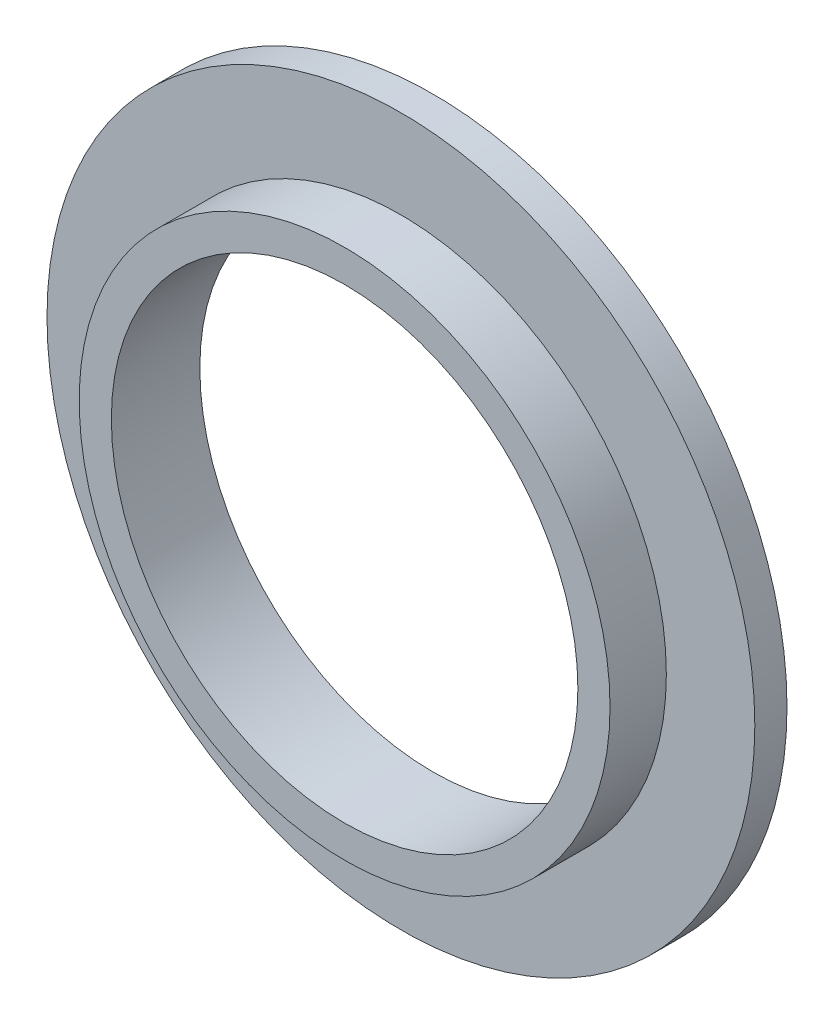
ISO-10303-21;
HEADER;
FILE_DESCRIPTION(('STEP AP214'),'2;1');
FILE_NAME('part.step','',(''),(''),'','','');
FILE_SCHEMA(('AUTOMOTIVE_DESIGN { 1 0 10303 214 1 1 1 1 }'));
ENDSEC;
DATA;
#1=APPLICATION_CONTEXT('core data for automotive mechanical design processes');
#2=APPLICATION_PROTOCOL_DEFINITION('international standard','automotive_design',2000,#1);
#3=PRODUCT_CONTEXT('',#1,'mechanical');
#4=PRODUCT('Part','Part','',(#3));
#5=PRODUCT_RELATED_PRODUCT_CATEGORY('part','',(#4));
#6=PRODUCT_DEFINITION_FORMATION('','',#4);
#7=PRODUCT_DEFINITION_CONTEXT('part definition',#1,'design');
#8=PRODUCT_DEFINITION('design','',#6,#7);
#9=PRODUCT_DEFINITION_SHAPE('','',#8);
#10=(LENGTH_UNIT() NAMED_UNIT(*) SI_UNIT(.MILLI.,.METRE.));
#11=(NAMED_UNIT(*) PLANE_ANGLE_UNIT() SI_UNIT($,.RADIAN.));
#12=(NAMED_UNIT(*) SI_UNIT($,.STERADIAN.) SOLID_ANGLE_UNIT());
#13=UNCERTAINTY_MEASURE_WITH_UNIT(LENGTH_MEASURE(1.E-05),#10,'distance_accuracy_value','');
#14=(GEOMETRIC_REPRESENTATION_CONTEXT(3) GLOBAL_UNCERTAINTY_ASSIGNED_CONTEXT((#13)) GLOBAL_UNIT_ASSIGNED_CONTEXT((#10,
#11,#12)) REPRESENTATION_CONTEXT('',''));
#15=CARTESIAN_POINT('',(0.,0.,0.));
#16=DIRECTION('',(0.,0.,1.));
#17=DIRECTION('',(1.,0.,0.));
#18=AXIS2_PLACEMENT_3D('',#15,#16,#17);
#19=CARTESIAN_POINT('',(0.,0.,4.));
#20=DIRECTION('',(0.,0.,-1.));
#21=DIRECTION('',(-1.,0.,0.));
#22=AXIS2_PLACEMENT_3D('',#19,#20,#21);
#23=CYLINDRICAL_SURFACE('',#22,44.);
#24=CARTESIAN_POINT('',(0.,0.,4.));
#25=DIRECTION('',(0.,0.,1.));
#26=DIRECTION('',(1.,0.,0.));
#27=AXIS2_PLACEMENT_3D('',#24,#25,#26);
#28=CIRCLE('',#27,44.);
#29=CARTESIAN_POINT('',(44.,0.,4.));
#30=VERTEX_POINT('',#29);
#31=EDGE_CURVE('E48',#30,#30,#28,.T.);
#32=ORIENTED_EDGE('',*,*,#31,.F.);
#33=EDGE_LOOP('',(#32));
#34=FACE_BOUND('',#33,.T.);
#35=CARTESIAN_POINT('',(0.,0.,0.));
#36=DIRECTION('',(0.,0.,1.));
#37=DIRECTION('',(1.,0.,0.));
#38=AXIS2_PLACEMENT_3D('',#35,#36,#37);
#39=CIRCLE('',#38,44.);
#40=CARTESIAN_POINT('',(44.,0.,0.));
#41=VERTEX_POINT('',#40);
#42=EDGE_CURVE('E53',#41,#41,#39,.T.);
#43=ORIENTED_EDGE('',*,*,#42,.T.);
#44=EDGE_LOOP('',(#43));
#45=FACE_BOUND('',#44,.T.);
#46=ADVANCED_FACE('F41',(#34,#45),#23,.T.);
#47=CARTESIAN_POINT('',(0.,0.,4.));
#48=DIRECTION('',(0.,0.,1.));
#49=DIRECTION('',(1.,0.,0.));
#50=AXIS2_PLACEMENT_3D('',#47,#48,#49);
#51=PLANE('',#50);
#52=CARTESIAN_POINT('',(0.,0.,4.));
#53=DIRECTION('',(0.,0.,1.));
#54=DIRECTION('',(1.,0.,0.));
#55=AXIS2_PLACEMENT_3D('',#52,#53,#54);
#56=CIRCLE('',#55,33.);
#57=CARTESIAN_POINT('',(33.,0.,4.));
#58=VERTEX_POINT('',#57);
#59=EDGE_CURVE('E10',#58,#58,#56,.T.);
#60=ORIENTED_EDGE('',*,*,#59,.F.);
#61=EDGE_LOOP('',(#60));
#62=FACE_BOUND('',#61,.T.);
#63=ORIENTED_EDGE('',*,*,#31,.T.);
#64=EDGE_LOOP('',(#63));
#65=FACE_BOUND('',#64,.T.);
#66=ADVANCED_FACE('F85',(#62,#65),#51,.T.);
#67=CARTESIAN_POINT('',(0.,0.,0.));
#68=DIRECTION('',(0.,0.,1.));
#69=DIRECTION('',(1.,0.,0.));
#70=AXIS2_PLACEMENT_3D('',#67,#68,#69);
#71=PLANE('',#70);
#72=CARTESIAN_POINT('',(0.,0.,0.));
#73=DIRECTION('',(0.,0.,1.));
#74=DIRECTION('',(1.,0.,0.));
#75=AXIS2_PLACEMENT_3D('',#72,#73,#74);
#76=CIRCLE('',#75,29.);
#77=CARTESIAN_POINT('',(29.,0.,0.));
#78=VERTEX_POINT('',#77);
#79=EDGE_CURVE('E65',#78,#78,#76,.T.);
#80=ORIENTED_EDGE('',*,*,#79,.T.);
#81=EDGE_LOOP('',(#80));
#82=FACE_BOUND('',#81,.T.);
#83=ORIENTED_EDGE('',*,*,#42,.F.);
#84=EDGE_LOOP('',(#83));
#85=FACE_BOUND('',#84,.T.);
#86=ADVANCED_FACE('F71',(#82,#85),#71,.F.);
#87=CARTESIAN_POINT('',(0.,0.,11.));
#88=DIRECTION('',(0.,0.,-1.));
#89=DIRECTION('',(-1.,0.,0.));
#90=AXIS2_PLACEMENT_3D('',#87,#88,#89);
#91=CYLINDRICAL_SURFACE('',#90,33.);
#92=CARTESIAN_POINT('',(0.,0.,11.));
#93=DIRECTION('',(0.,0.,1.));
#94=DIRECTION('',(1.,0.,0.));
#95=AXIS2_PLACEMENT_3D('',#92,#93,#94);
#96=CIRCLE('',#95,33.);
#97=CARTESIAN_POINT('',(33.,0.,11.));
#98=VERTEX_POINT('',#97);
#99=EDGE_CURVE('E56',#98,#98,#96,.T.);
#100=ORIENTED_EDGE('',*,*,#99,.F.);
#101=EDGE_LOOP('',(#100));
#102=FACE_BOUND('',#101,.T.);
#103=ORIENTED_EDGE('',*,*,#59,.T.);
#104=EDGE_LOOP('',(#103));
#105=FACE_BOUND('',#104,.T.);
#106=ADVANCED_FACE('F81',(#102,#105),#91,.T.);
#107=CARTESIAN_POINT('',(0.,0.,11.));
#108=DIRECTION('',(0.,0.,1.));
#109=DIRECTION('',(1.,0.,0.));
#110=AXIS2_PLACEMENT_3D('',#107,#108,#109);
#111=PLANE('',#110);
#112=CARTESIAN_POINT('',(0.,0.,11.));
#113=DIRECTION('',(0.,0.,1.));
#114=DIRECTION('',(1.,0.,0.));
#115=AXIS2_PLACEMENT_3D('',#112,#113,#114);
#116=CIRCLE('',#115,29.);
#117=CARTESIAN_POINT('',(29.,0.,11.));
#118=VERTEX_POINT('',#117);
#119=EDGE_CURVE('E44',#118,#118,#116,.T.);
#120=ORIENTED_EDGE('',*,*,#119,.F.);
#121=EDGE_LOOP('',(#120));
#122=FACE_BOUND('',#121,.T.);
#123=ORIENTED_EDGE('',*,*,#99,.T.);
#124=EDGE_LOOP('',(#123));
#125=FACE_BOUND('',#124,.T.);
#126=ADVANCED_FACE('F76',(#122,#125),#111,.T.);
#127=CARTESIAN_POINT('',(0.,0.,0.));
#128=DIRECTION('',(0.,0.,1.));
#129=DIRECTION('',(1.,0.,0.));
#130=AXIS2_PLACEMENT_3D('',#127,#128,#129);
#131=CYLINDRICAL_SURFACE('',#130,29.);
#132=ORIENTED_EDGE('',*,*,#119,.T.);
#133=EDGE_LOOP('',(#132));
#134=FACE_BOUND('',#133,.T.);
#135=ORIENTED_EDGE('',*,*,#79,.F.);
#136=EDGE_LOOP('',(#135));
#137=FACE_BOUND('',#136,.T.);
#138=ADVANCED_FACE('F74',(#134,#137),#131,.F.);
#139=CLOSED_SHELL('',(#46,#66,#86,#106,#126,#138));
#140=MANIFOLD_SOLID_BREP('B2',#139);
#141=ADVANCED_BREP_SHAPE_REPRESENTATION('',(#18,#140),#14);
#142=SHAPE_DEFINITION_REPRESENTATION(#9,#141);
ENDSEC;
END-ISO-10303-21;
